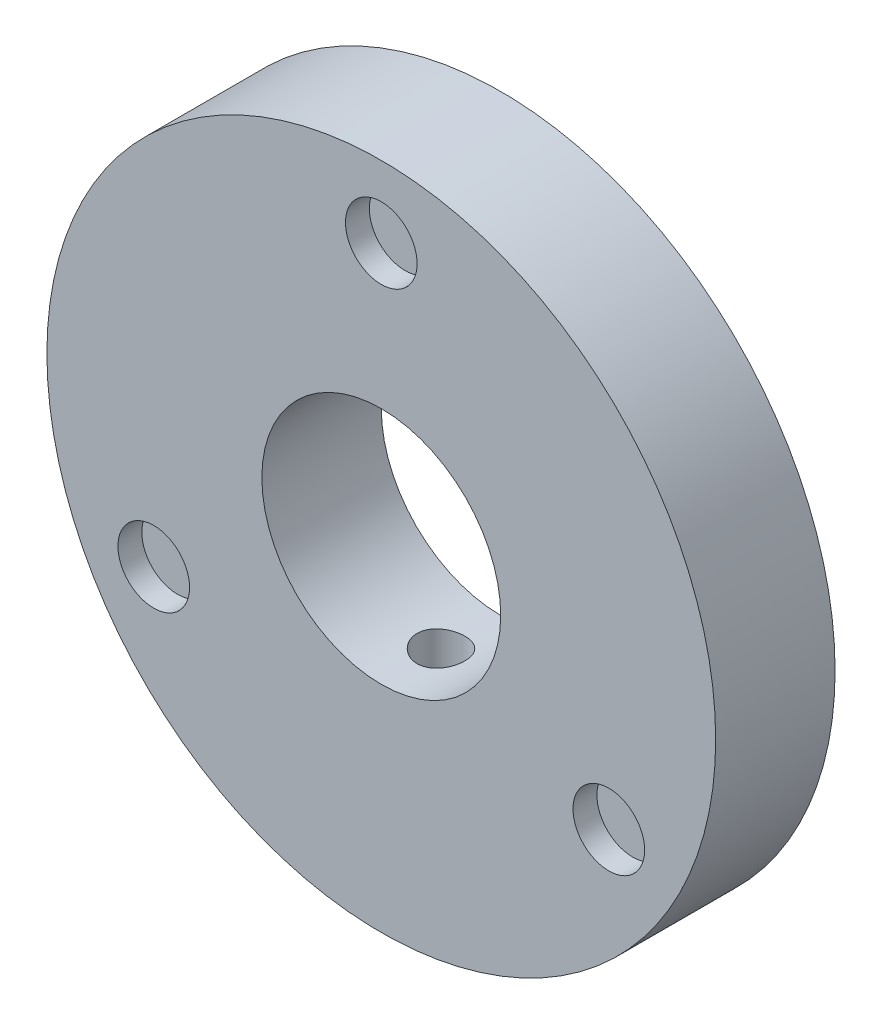
ISO-10303-21;
HEADER;
FILE_DESCRIPTION(('STEP AP214'),'2;1');
FILE_NAME('part.step','',(''),(''),'','','');
FILE_SCHEMA(('AUTOMOTIVE_DESIGN { 1 0 10303 214 1 1 1 1 }'));
ENDSEC;
DATA;
#1=APPLICATION_CONTEXT('core data for automotive mechanical design processes');
#2=APPLICATION_PROTOCOL_DEFINITION('international standard','automotive_design',2000,#1);
#3=PRODUCT_CONTEXT('',#1,'mechanical');
#4=PRODUCT('Part','Part','',(#3));
#5=PRODUCT_RELATED_PRODUCT_CATEGORY('part','',(#4));
#6=PRODUCT_DEFINITION_FORMATION('','',#4);
#7=PRODUCT_DEFINITION_CONTEXT('part definition',#1,'design');
#8=PRODUCT_DEFINITION('design','',#6,#7);
#9=PRODUCT_DEFINITION_SHAPE('','',#8);
#10=(LENGTH_UNIT() NAMED_UNIT(*) SI_UNIT(.MILLI.,.METRE.));
#11=(NAMED_UNIT(*) PLANE_ANGLE_UNIT() SI_UNIT($,.RADIAN.));
#12=(NAMED_UNIT(*) SI_UNIT($,.STERADIAN.) SOLID_ANGLE_UNIT());
#13=UNCERTAINTY_MEASURE_WITH_UNIT(LENGTH_MEASURE(1.E-05),#10,'distance_accuracy_value','');
#14=(GEOMETRIC_REPRESENTATION_CONTEXT(3) GLOBAL_UNCERTAINTY_ASSIGNED_CONTEXT((#13)) GLOBAL_UNIT_ASSIGNED_CONTEXT((#10,
#11,#12)) REPRESENTATION_CONTEXT('',''));
#15=CARTESIAN_POINT('',(0.,0.,0.));
#16=DIRECTION('',(0.,0.,1.));
#17=DIRECTION('',(1.,0.,0.));
#18=AXIS2_PLACEMENT_3D('',#15,#16,#17);
#19=CARTESIAN_POINT('',(0.,0.,5.));
#20=DIRECTION('',(0.,0.,1.));
#21=DIRECTION('',(1.,0.,0.));
#22=AXIS2_PLACEMENT_3D('',#19,#20,#21);
#23=PLANE('',#22);
#24=CARTESIAN_POINT('',(0.,11.,5.));
#25=DIRECTION('',(0.,0.,1.));
#26=DIRECTION('',(1.,0.,0.));
#27=AXIS2_PLACEMENT_3D('',#24,#25,#26);
#28=CIRCLE('',#27,1.5);
#29=CARTESIAN_POINT('',(1.5,11.,5.));
#30=VERTEX_POINT('',#29);
#31=EDGE_CURVE('E72',#30,#30,#28,.T.);
#32=ORIENTED_EDGE('',*,*,#31,.F.);
#33=EDGE_LOOP('',(#32));
#34=FACE_BOUND('',#33,.T.);
#35=CARTESIAN_POINT('',(9.52627944162883,-5.5,5.));
#36=DIRECTION('',(0.,0.,1.));
#37=DIRECTION('',(1.,0.,0.));
#38=AXIS2_PLACEMENT_3D('',#35,#36,#37);
#39=CIRCLE('',#38,1.5);
#40=CARTESIAN_POINT('',(11.0262794416288,-5.5,5.));
#41=VERTEX_POINT('',#40);
#42=EDGE_CURVE('E66',#41,#41,#39,.T.);
#43=ORIENTED_EDGE('',*,*,#42,.F.);
#44=EDGE_LOOP('',(#43));
#45=FACE_BOUND('',#44,.T.);
#46=CARTESIAN_POINT('',(-9.52627944162882,-5.50000000000001,5.));
#47=DIRECTION('',(0.,0.,1.));
#48=DIRECTION('',(1.,0.,0.));
#49=AXIS2_PLACEMENT_3D('',#46,#47,#48);
#50=CIRCLE('',#49,1.5);
#51=CARTESIAN_POINT('',(-8.02627944162882,-5.50000000000001,5.));
#52=VERTEX_POINT('',#51);
#53=EDGE_CURVE('E59',#52,#52,#50,.T.);
#54=ORIENTED_EDGE('',*,*,#53,.F.);
#55=EDGE_LOOP('',(#54));
#56=FACE_BOUND('',#55,.T.);
#57=CARTESIAN_POINT('',(0.,0.,5.));
#58=DIRECTION('',(0.,0.,1.));
#59=DIRECTION('',(1.,0.,0.));
#60=AXIS2_PLACEMENT_3D('',#57,#58,#59);
#61=CIRCLE('',#60,14.);
#62=CARTESIAN_POINT('',(14.,0.,5.));
#63=VERTEX_POINT('',#62);
#64=EDGE_CURVE('E10',#63,#63,#61,.T.);
#65=ORIENTED_EDGE('',*,*,#64,.T.);
#66=EDGE_LOOP('',(#65));
#67=FACE_BOUND('',#66,.T.);
#68=CARTESIAN_POINT('',(0.,0.,5.));
#69=DIRECTION('',(0.,0.,1.));
#70=DIRECTION('',(1.,0.,0.));
#71=AXIS2_PLACEMENT_3D('',#68,#69,#70);
#72=CIRCLE('',#71,5.);
#73=CARTESIAN_POINT('',(5.,0.,5.));
#74=VERTEX_POINT('',#73);
#75=EDGE_CURVE('E51',#74,#74,#72,.T.);
#76=ORIENTED_EDGE('',*,*,#75,.F.);
#77=EDGE_LOOP('',(#76));
#78=FACE_BOUND('',#77,.T.);
#79=ADVANCED_FACE('F32',(#34,#45,#56,#67,#78),#23,.T.);
#80=CARTESIAN_POINT('',(0.,0.,0.));
#81=DIRECTION('',(0.,0.,1.));
#82=DIRECTION('',(1.,0.,0.));
#83=AXIS2_PLACEMENT_3D('',#80,#81,#82);
#84=PLANE('',#83);
#85=CARTESIAN_POINT('',(0.,11.,0.));
#86=DIRECTION('',(0.,0.,-1.));
#87=DIRECTION('',(-1.,0.,0.));
#88=AXIS2_PLACEMENT_3D('',#85,#86,#87);
#89=CIRCLE('',#88,1.5);
#90=CARTESIAN_POINT('',(-1.5,11.,0.));
#91=VERTEX_POINT('',#90);
#92=EDGE_CURVE('E90',#91,#91,#89,.T.);
#93=ORIENTED_EDGE('',*,*,#92,.F.);
#94=EDGE_LOOP('',(#93));
#95=FACE_BOUND('',#94,.T.);
#96=CARTESIAN_POINT('',(-9.52627944162883,-5.5,0.));
#97=DIRECTION('',(0.,0.,-1.));
#98=DIRECTION('',(-1.,0.,0.));
#99=AXIS2_PLACEMENT_3D('',#96,#97,#98);
#100=CIRCLE('',#99,1.5);
#101=CARTESIAN_POINT('',(-11.0262794416288,-5.5,0.));
#102=VERTEX_POINT('',#101);
#103=EDGE_CURVE('E87',#102,#102,#100,.T.);
#104=ORIENTED_EDGE('',*,*,#103,.F.);
#105=EDGE_LOOP('',(#104));
#106=FACE_BOUND('',#105,.T.);
#107=CARTESIAN_POINT('',(9.52627944162882,-5.50000000000001,0.));
#108=DIRECTION('',(0.,0.,-1.));
#109=DIRECTION('',(-1.,0.,0.));
#110=AXIS2_PLACEMENT_3D('',#107,#108,#109);
#111=CIRCLE('',#110,1.5);
#112=CARTESIAN_POINT('',(8.02627944162882,-5.50000000000001,0.));
#113=VERTEX_POINT('',#112);
#114=EDGE_CURVE('E80',#113,#113,#111,.T.);
#115=ORIENTED_EDGE('',*,*,#114,.F.);
#116=EDGE_LOOP('',(#115));
#117=FACE_BOUND('',#116,.T.);
#118=CARTESIAN_POINT('',(0.,0.,0.));
#119=DIRECTION('',(0.,0.,1.));
#120=DIRECTION('',(1.,0.,0.));
#121=AXIS2_PLACEMENT_3D('',#118,#119,#120);
#122=CIRCLE('',#121,14.);
#123=CARTESIAN_POINT('',(14.,0.,0.));
#124=VERTEX_POINT('',#123);
#125=EDGE_CURVE('E46',#124,#124,#122,.T.);
#126=ORIENTED_EDGE('',*,*,#125,.F.);
#127=EDGE_LOOP('',(#126));
#128=FACE_BOUND('',#127,.T.);
#129=CARTESIAN_POINT('',(0.,0.,0.));
#130=DIRECTION('',(0.,0.,1.));
#131=DIRECTION('',(1.,0.,0.));
#132=AXIS2_PLACEMENT_3D('',#129,#130,#131);
#133=CIRCLE('',#132,5.);
#134=CARTESIAN_POINT('',(5.,0.,0.));
#135=VERTEX_POINT('',#134);
#136=EDGE_CURVE('E53',#135,#135,#133,.T.);
#137=ORIENTED_EDGE('',*,*,#136,.T.);
#138=EDGE_LOOP('',(#137));
#139=FACE_BOUND('',#138,.T.);
#140=ADVANCED_FACE('F158',(#95,#106,#117,#128,#139),#84,.F.);
#141=CARTESIAN_POINT('',(0.,0.,5.));
#142=DIRECTION('',(0.,0.,-1.));
#143=DIRECTION('',(-1.,0.,0.));
#144=AXIS2_PLACEMENT_3D('',#141,#142,#143);
#145=CYLINDRICAL_SURFACE('',#144,14.);
#146=CARTESIAN_POINT('',(0.,-14.,3.5));
#147=CARTESIAN_POINT('',(0.0560937195875968,-13.9999995278805,3.49999753867449));
#148=CARTESIAN_POINT('',(0.112226286909792,-13.9996592735534,3.49526437569554));
#149=CARTESIAN_POINT('',(0.222940242827825,-13.9983346441886,3.47645147837645));
#150=CARTESIAN_POINT('',(0.277519769309011,-13.9973495273213,3.46236097938437));
#151=CARTESIAN_POINT('',(0.383508005273699,-13.9948465687616,3.42524127839965));
#152=CARTESIAN_POINT('',(0.434918417825353,-13.9933290161844,3.40221692681631));
#153=CARTESIAN_POINT('',(0.533131800700576,-13.9899316725367,3.34789129106972));
#154=CARTESIAN_POINT('',(0.57993579553587,-13.9880519622899,3.31659185310009));
#155=CARTESIAN_POINT('',(0.667710230995083,-13.9841374302049,3.24653942765135));
#156=CARTESIAN_POINT('',(0.708670674835206,-13.9821023514875,3.20777392767183));
#157=CARTESIAN_POINT('',(0.78350966245635,-13.9781086249156,3.12391591647805));
#158=CARTESIAN_POINT('',(0.81738790447027,-13.9761499803208,3.07882313580004));
#159=CARTESIAN_POINT('',(0.877133128857929,-13.9725279575697,2.98353201713844));
#160=CARTESIAN_POINT('',(0.90299156825972,-13.9708648950769,2.93332830989091));
#161=CARTESIAN_POINT('',(0.945908548498533,-13.9680249962908,2.8292779831948));
#162=CARTESIAN_POINT('',(0.962967207803804,-13.9668481534516,2.77543141279981));
#163=CARTESIAN_POINT('',(0.987772023433274,-13.9651159100812,2.66572214449709));
#164=CARTESIAN_POINT('',(0.995534159645548,-13.9645594432936,2.60986307668516));
#165=CARTESIAN_POINT('',(1.00157493594699,-13.9641275159217,2.49763231997803));
#166=CARTESIAN_POINT('',(0.99985371118415,-13.9642520456326,2.44126063839954));
#167=CARTESIAN_POINT('',(0.986989860817261,-13.9651670787271,2.32971396830984));
#168=CARTESIAN_POINT('',(0.975864556029973,-13.9659563577387,2.27453697087491));
#169=CARTESIAN_POINT('',(0.944535235783244,-13.9681100244431,2.16683556864293));
#170=CARTESIAN_POINT('',(0.924331152377876,-13.96947441644,2.11431118370139));
#171=CARTESIAN_POINT('',(0.875398237128788,-13.9726259720332,2.01335050619488));
#172=CARTESIAN_POINT('',(0.846661581972846,-13.9744135233079,1.96491801797012));
#173=CARTESIAN_POINT('',(0.781484907158016,-13.9782095917553,1.87355754839371));
#174=CARTESIAN_POINT('',(0.745044773537618,-13.9802181121968,1.83062964848936));
#175=CARTESIAN_POINT('',(0.665398149886682,-13.984235230407,1.75139617145384));
#176=CARTESIAN_POINT('',(0.622176676204539,-13.9862438182577,1.71510565389189));
#177=CARTESIAN_POINT('',(0.53024669789692,-13.9900304220396,1.6502933651881));
#178=CARTESIAN_POINT('',(0.481538190751583,-13.9918084378649,1.62177159761398));
#179=CARTESIAN_POINT('',(0.380007407817873,-13.994933765921,1.57330757819669));
#180=CARTESIAN_POINT('',(0.327184840612682,-13.9962810476064,1.55336593477507));
#181=CARTESIAN_POINT('',(0.21892961717693,-13.9983927136546,1.52263848337019));
#182=CARTESIAN_POINT('',(0.163497000757618,-13.999157106905,1.51185253578223));
#183=CARTESIAN_POINT('',(0.0517258175123514,-14.0000157229619,1.49976139665272));
#184=CARTESIAN_POINT('',(-0.00461048696706186,-14.0001114170013,1.4984353917618));
#185=CARTESIAN_POINT('',(-0.116704668210878,-13.9996257716428,1.50524734058643));
#186=CARTESIAN_POINT('',(-0.172462548919165,-13.9990444368641,1.51338522973121));
#187=CARTESIAN_POINT('',(-0.28175820880638,-13.9972710975546,1.53887672153325));
#188=CARTESIAN_POINT('',(-0.335298235381059,-13.9960797283995,1.55622073632118));
#189=CARTESIAN_POINT('',(-0.438707847884634,-13.9932202732766,1.59962238774067));
#190=CARTESIAN_POINT('',(-0.488577390838616,-13.9915521817285,1.62568012637483));
#191=CARTESIAN_POINT('',(-0.583325502595738,-13.9879228706297,1.68582225842689));
#192=CARTESIAN_POINT('',(-0.628195256183018,-13.9859611472029,1.71992050849886));
#193=CARTESIAN_POINT('',(-0.711581265417024,-13.9819668932191,1.79515563076915));
#194=CARTESIAN_POINT('',(-0.750097439789152,-13.9799343617568,1.83629259299253));
#195=CARTESIAN_POINT('',(-0.81975381457621,-13.9760232690702,1.92452741632608));
#196=CARTESIAN_POINT('',(-0.850880480900123,-13.974144994423,1.97163597627656));
#197=CARTESIAN_POINT('',(-0.904781606169517,-13.9707588458058,2.07042319255101));
#198=CARTESIAN_POINT('',(-0.927556129312018,-13.9692509689889,2.12210181374435));
#199=CARTESIAN_POINT('',(-0.96408319547906,-13.9667777512985,2.22851334831294));
#200=CARTESIAN_POINT('',(-0.977844164670157,-13.9658119038395,2.28324335705281));
#201=CARTESIAN_POINT('',(-0.995980985892052,-13.9645302759542,2.39424420130998));
#202=CARTESIAN_POINT('',(-1.00035696518647,-13.9642144867129,2.45051501592297));
#203=CARTESIAN_POINT('',(-0.999598277849288,-13.9642688059132,2.56286562007566));
#204=CARTESIAN_POINT('',(-0.994484882611355,-13.9646373802855,2.61894555523455));
#205=CARTESIAN_POINT('',(-0.97493679967559,-13.9660156418296,2.72944824111976));
#206=CARTESIAN_POINT('',(-0.960502096014837,-13.9670253300994,2.78387098900793));
#207=CARTESIAN_POINT('',(-0.922726193408387,-13.9695716568286,2.88951687093171));
#208=CARTESIAN_POINT('',(-0.899385209704891,-13.9711082825533,2.94074008225718));
#209=CARTESIAN_POINT('',(-0.844461950401682,-13.9745353329988,3.03854388176373));
#210=CARTESIAN_POINT('',(-0.812879855002503,-13.9764257499833,3.08512457142764));
#211=CARTESIAN_POINT('',(-0.742291437596059,-13.9803523591158,3.17242950905793));
#212=CARTESIAN_POINT('',(-0.703269532385188,-13.9823888515422,3.21314114381902));
#213=CARTESIAN_POINT('',(-0.61893408145744,-13.9863754687088,3.28745127369324));
#214=CARTESIAN_POINT('',(-0.573619005588184,-13.9883255722913,3.32104803382943));
#215=CARTESIAN_POINT('',(-0.477918062635485,-13.9919222785503,3.38020732764371));
#216=CARTESIAN_POINT('',(-0.427524792880305,-13.9935684279518,3.4057579017573));
#217=CARTESIAN_POINT('',(-0.323187539568072,-13.9963660310782,3.4480034113939));
#218=CARTESIAN_POINT('',(-0.26924776678137,-13.9975180596647,3.46470864295096));
#219=CARTESIAN_POINT('',(-0.179152112836641,-13.9988981353566,3.4844817090603));
#220=CARTESIAN_POINT('',(-0.143577497674366,-13.9993094807295,3.49029346117997));
#221=CARTESIAN_POINT('',(-0.0720072582065522,-13.9998605643465,3.49805339312684));
#222=CARTESIAN_POINT('',(-0.0360116346850093,-14.0000003030963,3.50000158014758));
#223=CARTESIAN_POINT('',(0.,-14.,3.5));
#224=B_SPLINE_CURVE_WITH_KNOTS('',3,(#146,#147,#148,#149,#150,#151,#152,#153,#154,#155,#156,
#157,#158,#159,#160,#161,#162,#163,#164,#165,#166,#167,#168,#169,#170,#171,#172,#173,#174,#175,
#176,#177,#178,#179,#180,#181,#182,#183,#184,#185,#186,#187,#188,#189,#190,#191,#192,#193,#194,
#195,#196,#197,#198,#199,#200,#201,#202,#203,#204,#205,#206,#207,#208,#209,#210,#211,#212,#213,
#214,#215,#216,#217,#218,#219,#220,#221,#222,#223),.UNSPECIFIED.,.T.,.F.,(4,2,2,2,2,2,2,2,2,2,2,
2,2,2,2,2,2,2,2,2,2,2,2,2,2,2,2,2,2,2,2,2,2,2,2,2,2,2,4),(0.,0.168149687948044,
0.336493150675189,0.504745343175834,0.672960029798431,0.841459122776077,1.00996539390609,
1.17865055208821,1.34733343926393,1.51572595765043,1.68411607627045,1.85219672122828,
2.02027862412909,2.18851511573185,2.35675409631754,2.52537018332172,2.69398634776129,
2.86261446690092,3.03124001477765,3.19949444540965,3.36774772807264,3.53582612344575,
3.7039064864087,3.87227865618554,4.04065297960196,4.20933334637233,4.37801241658876,
4.54653357415658,4.71505244650629,4.88319402294935,5.05133588733887,5.2194736884233,
5.38760781330676,5.55609805471973,5.72462933563736,5.89340994585913,6.06199366008891,
6.16994436212319,6.27789486316506),.UNSPECIFIED.);
#225=CARTESIAN_POINT('',(0.,-14.,3.5));
#226=VERTEX_POINT('',#225);
#227=EDGE_CURVE('E81',#226,#226,#224,.T.);
#228=ORIENTED_EDGE('',*,*,#227,.T.);
#229=EDGE_LOOP('',(#228));
#230=FACE_BOUND('',#229,.T.);
#231=ORIENTED_EDGE('',*,*,#64,.F.);
#232=EDGE_LOOP('',(#231));
#233=FACE_BOUND('',#232,.T.);
#234=ORIENTED_EDGE('',*,*,#125,.T.);
#235=EDGE_LOOP('',(#234));
#236=FACE_BOUND('',#235,.T.);
#237=ADVANCED_FACE('F34',(#230,#233,#236),#145,.T.);
#238=CARTESIAN_POINT('',(0.,0.,5.));
#239=DIRECTION('',(0.,0.,-1.));
#240=DIRECTION('',(-1.,0.,0.));
#241=AXIS2_PLACEMENT_3D('',#238,#239,#240);
#242=CYLINDRICAL_SURFACE('',#241,5.);
#243=CARTESIAN_POINT('',(0.,-5.,3.5));
#244=CARTESIAN_POINT('',(0.0555769067926332,-4.99999897580871,3.49999795550165));
#245=CARTESIAN_POINT('',(0.111179660201522,-4.99906385178231,3.49535115703235));
#246=CARTESIAN_POINT('',(0.220813507689019,-4.99542365623231,3.47690149988475));
#247=CARTESIAN_POINT('',(0.274843317541356,-4.99271717860186,3.46309136719849));
#248=CARTESIAN_POINT('',(0.379730305263313,-4.98583649278287,3.42675872637921));
#249=CARTESIAN_POINT('',(0.430590467933134,-4.98166369076718,3.40424456315531));
#250=CARTESIAN_POINT('',(0.527807988864225,-4.97230398035314,3.35116775248871));
#251=CARTESIAN_POINT('',(0.574165615075812,-4.96711713235707,3.3206055843928));
#252=CARTESIAN_POINT('',(0.661693477314865,-4.9562216532997,3.25186150570857));
#253=CARTESIAN_POINT('',(0.702793951158524,-4.95050745504347,3.2135916446088));
#254=CARTESIAN_POINT('',(0.778036756608028,-4.93924180452588,3.1307075836083));
#255=CARTESIAN_POINT('',(0.812178544770424,-4.93369036500424,3.08609288866488));
#256=CARTESIAN_POINT('',(0.87283175334762,-4.92332441812615,2.99128380698813));
#257=CARTESIAN_POINT('',(0.899270938865866,-4.91851707364946,2.94104235620364));
#258=CARTESIAN_POINT('',(0.943305666580308,-4.91026268058418,2.83671818099592));
#259=CARTESIAN_POINT('',(0.960902082437238,-4.90681549761962,2.78263583665366));
#260=CARTESIAN_POINT('',(0.986525299884827,-4.90172805252204,2.67291563609208));
#261=CARTESIAN_POINT('',(0.994674497958777,-4.90006470107188,2.61730745585777));
#262=CARTESIAN_POINT('',(1.00155212772612,-4.89866375060627,2.50549017863566));
#263=CARTESIAN_POINT('',(1.0002815227135,-4.89892595467841,2.44928114367986));
#264=CARTESIAN_POINT('',(0.988454573101819,-4.90132551148185,2.338753211979));
#265=CARTESIAN_POINT('',(0.978038540243905,-4.90343452858763,2.28441859437269));
#266=CARTESIAN_POINT('',(0.948437884623051,-4.90924546160001,2.178283923337));
#267=CARTESIAN_POINT('',(0.929252843100681,-4.91294745357779,2.12648399108099));
#268=CARTESIAN_POINT('',(0.88252478367472,-4.92155618500408,2.0264847382964));
#269=CARTESIAN_POINT('',(0.854926151232114,-4.92647089813704,1.97831212043083));
#270=CARTESIAN_POINT('',(0.792193574572679,-4.93694618773062,1.88722915002719));
#271=CARTESIAN_POINT('',(0.757058764356829,-4.94250683838366,1.84431940314884));
#272=CARTESIAN_POINT('',(0.679499934560584,-4.95377021241462,1.76417059754306));
#273=CARTESIAN_POINT('',(0.636956161212445,-4.95947369210905,1.72704743214087));
#274=CARTESIAN_POINT('',(0.54618502406201,-4.97028848714408,1.66044615369878));
#275=CARTESIAN_POINT('',(0.497957587379389,-4.97539979488974,1.63096813870642));
#276=CARTESIAN_POINT('',(0.397059386878921,-4.98446690160887,1.58047249077403));
#277=CARTESIAN_POINT('',(0.3443818195853,-4.98842088848272,1.55946810635546));
#278=CARTESIAN_POINT('',(0.236148976448665,-4.99471408987858,1.52663952596143));
#279=CARTESIAN_POINT('',(0.18059405007245,-4.99705350000531,1.51481421792637));
#280=CARTESIAN_POINT('',(0.0691794056271507,-4.99982671866868,1.50084354620572));
#281=CARTESIAN_POINT('',(0.0133403283255765,-5.0002917465247,1.49853958045973));
#282=CARTESIAN_POINT('',(-0.0979249341927137,-4.99935051930103,1.50324985894218));
#283=CARTESIAN_POINT('',(-0.153351142443793,-4.99794436941446,1.5102635793526));
#284=CARTESIAN_POINT('',(-0.26170565994654,-4.99343832008018,1.53327837354396));
#285=CARTESIAN_POINT('',(-0.314651948339902,-4.99035376404206,1.5491980684979));
#286=CARTESIAN_POINT('',(-0.417123627499667,-4.98283552061033,1.58948398265581));
#287=CARTESIAN_POINT('',(-0.466648761637539,-4.97840173214227,1.61385083467683));
#288=CARTESIAN_POINT('',(-0.561541173686217,-4.96859911533294,1.67068249065131));
#289=CARTESIAN_POINT('',(-0.606850126752187,-4.96321950437052,1.70324278103895));
#290=CARTESIAN_POINT('',(-0.691418019119206,-4.95214734829882,1.77540919120728));
#291=CARTESIAN_POINT('',(-0.730676308930762,-4.94645476968388,1.81501606639987));
#292=CARTESIAN_POINT('',(-0.802640590774176,-4.93529303556965,1.90087335189112));
#293=CARTESIAN_POINT('',(-0.835237702448655,-4.92982860233304,1.94721574422134));
#294=CARTESIAN_POINT('',(-0.892185420051205,-4.91984191796194,2.04481136135668));
#295=CARTESIAN_POINT('',(-0.916536355922902,-4.91531962913342,2.09606438957355));
#296=CARTESIAN_POINT('',(-0.95615184158196,-4.90776740584383,2.20176824614955));
#297=CARTESIAN_POINT('',(-0.97146349979105,-4.90472974872187,2.25620084121032));
#298=CARTESIAN_POINT('',(-0.992708651627196,-4.90047436792025,2.3669334534909));
#299=CARTESIAN_POINT('',(-0.998643368225112,-4.89925640691111,2.42323322620935));
#300=CARTESIAN_POINT('',(-1.00092091086747,-4.89879149631379,2.53500886454432));
#301=CARTESIAN_POINT('',(-0.997435788070896,-4.89950919189301,2.59048114892701));
#302=CARTESIAN_POINT('',(-0.981352304100061,-4.90275573484614,2.70003164990503));
#303=CARTESIAN_POINT('',(-0.968754016129298,-4.90528456767169,2.7541098776948));
#304=CARTESIAN_POINT('',(-0.934878568498954,-4.91185264219159,2.85922771124054));
#305=CARTESIAN_POINT('',(-0.913622506717345,-4.91588821018831,2.91027436050241));
#306=CARTESIAN_POINT('',(-0.863054644601604,-4.9250171497417,3.00810372073444));
#307=CARTESIAN_POINT('',(-0.833742168774882,-4.93011060998894,3.05488607372514));
#308=CARTESIAN_POINT('',(-0.767305914786414,-4.94088960523225,3.14371557215031));
#309=CARTESIAN_POINT('',(-0.730057887235181,-4.94658372909699,3.1856687652676));
#310=CARTESIAN_POINT('',(-0.649064369013141,-4.95786081871955,3.26278620552917));
#311=CARTESIAN_POINT('',(-0.605317387153335,-4.96344375863184,3.29794889031727));
#312=CARTESIAN_POINT('',(-0.512017629088247,-4.97393832387971,3.36083464394645));
#313=CARTESIAN_POINT('',(-0.462408884429835,-4.97884231219246,3.38847600328003));
#314=CARTESIAN_POINT('',(-0.359166360940733,-4.98735125085,3.43498612259659));
#315=CARTESIAN_POINT('',(-0.305536260863127,-4.99095737138616,3.45386278953249));
#316=CARTESIAN_POINT('',(-0.20982148892378,-4.99576372595371,3.47865194804472));
#317=CARTESIAN_POINT('',(-0.168281664013785,-4.99734303158452,3.48664319370776));
#318=CARTESIAN_POINT('',(-0.0844995252100675,-4.99946154139893,3.49731791235836));
#319=CARTESIAN_POINT('',(-0.0422572337486193,-5.00000077873155,3.50000155450977));
#320=CARTESIAN_POINT('',(0.,-5.,3.5));
#321=B_SPLINE_CURVE_WITH_KNOTS('',3,(#243,#244,#245,#246,#247,#248,#249,#250,#251,#252,#253,
#254,#255,#256,#257,#258,#259,#260,#261,#262,#263,#264,#265,#266,#267,#268,#269,#270,#271,#272,
#273,#274,#275,#276,#277,#278,#279,#280,#281,#282,#283,#284,#285,#286,#287,#288,#289,#290,#291,
#292,#293,#294,#295,#296,#297,#298,#299,#300,#301,#302,#303,#304,#305,#306,#307,#308,#309,#310,
#311,#312,#313,#314,#315,#316,#317,#318,#319,#320),.UNSPECIFIED.,.T.,.F.,(4,2,2,2,2,2,2,2,2,2,2,
2,2,2,2,2,2,2,2,2,2,2,2,2,2,2,2,2,2,2,2,2,2,2,2,2,2,2,4),(0.,0.166576130661258,
0.333284650691323,0.499833735250341,0.666372902230863,0.834932670112185,1.00350559674736,
1.17361195005923,1.34370149365197,1.51156185103587,1.67940504281225,1.84471727006278,
2.0100373925373,2.17647490203593,2.3429315474967,2.51238252491351,2.6818356753982,
2.85155274854024,3.02124925698036,3.18810735676265,3.35495607657868,3.52030453950723,
3.68566539216022,3.85305066033359,4.0204538834593,4.19040628579226,4.36035188723466,
4.52940381032723,4.69843368330415,4.86439722567701,5.03035943492608,5.1959196125311,
5.36149367581867,5.52988076239143,5.6983065453293,5.86849496675637,6.03852955517518,
6.16518775289894,6.29184191370996),.UNSPECIFIED.);
#322=CARTESIAN_POINT('',(0.,-5.,3.5));
#323=VERTEX_POINT('',#322);
#324=EDGE_CURVE('E37',#323,#323,#321,.T.);
#325=ORIENTED_EDGE('',*,*,#324,.F.);
#326=EDGE_LOOP('',(#325));
#327=FACE_BOUND('',#326,.T.);
#328=ORIENTED_EDGE('',*,*,#75,.T.);
#329=EDGE_LOOP('',(#328));
#330=FACE_BOUND('',#329,.T.);
#331=ORIENTED_EDGE('',*,*,#136,.F.);
#332=EDGE_LOOP('',(#331));
#333=FACE_BOUND('',#332,.T.);
#334=ADVANCED_FACE('F151',(#327,#330,#333),#242,.F.);
#335=CARTESIAN_POINT('',(-9.52627944162882,-5.50000000000001,4.));
#336=DIRECTION('',(0.,0.,1.));
#337=DIRECTION('',(1.,0.,0.));
#338=AXIS2_PLACEMENT_3D('',#335,#336,#337);
#339=CYLINDRICAL_SURFACE('',#338,1.5);
#340=CARTESIAN_POINT('',(-9.52627944162882,-5.50000000000001,4.));
#341=DIRECTION('',(0.,0.,1.));
#342=DIRECTION('',(1.,0.,0.));
#343=AXIS2_PLACEMENT_3D('',#340,#341,#342);
#344=CIRCLE('',#343,1.5);
#345=CARTESIAN_POINT('',(-8.02627944162882,-5.50000000000001,4.));
#346=VERTEX_POINT('',#345);
#347=EDGE_CURVE('E62',#346,#346,#344,.T.);
#348=ORIENTED_EDGE('',*,*,#347,.F.);
#349=EDGE_LOOP('',(#348));
#350=FACE_BOUND('',#349,.T.);
#351=ORIENTED_EDGE('',*,*,#53,.T.);
#352=EDGE_LOOP('',(#351));
#353=FACE_BOUND('',#352,.T.);
#354=ADVANCED_FACE('F148',(#350,#353),#339,.F.);
#355=CARTESIAN_POINT('',(-9.52627944162882,-5.50000000000001,4.));
#356=DIRECTION('',(0.,0.,1.));
#357=DIRECTION('',(1.,0.,0.));
#358=AXIS2_PLACEMENT_3D('',#355,#356,#357);
#359=PLANE('',#358);
#360=ORIENTED_EDGE('',*,*,#347,.T.);
#361=EDGE_LOOP('',(#360));
#362=FACE_BOUND('',#361,.T.);
#363=ADVANCED_FACE('F144',(#362),#359,.T.);
#364=CARTESIAN_POINT('',(9.52627944162883,-5.5,4.));
#365=DIRECTION('',(0.,0.,1.));
#366=DIRECTION('',(1.,0.,0.));
#367=AXIS2_PLACEMENT_3D('',#364,#365,#366);
#368=CYLINDRICAL_SURFACE('',#367,1.5);
#369=CARTESIAN_POINT('',(9.52627944162883,-5.5,4.));
#370=DIRECTION('',(0.,0.,1.));
#371=DIRECTION('',(1.,0.,0.));
#372=AXIS2_PLACEMENT_3D('',#369,#370,#371);
#373=CIRCLE('',#372,1.5);
#374=CARTESIAN_POINT('',(11.0262794416288,-5.5,4.));
#375=VERTEX_POINT('',#374);
#376=EDGE_CURVE('E69',#375,#375,#373,.T.);
#377=ORIENTED_EDGE('',*,*,#376,.F.);
#378=EDGE_LOOP('',(#377));
#379=FACE_BOUND('',#378,.T.);
#380=ORIENTED_EDGE('',*,*,#42,.T.);
#381=EDGE_LOOP('',(#380));
#382=FACE_BOUND('',#381,.T.);
#383=ADVANCED_FACE('F140',(#379,#382),#368,.F.);
#384=CARTESIAN_POINT('',(9.52627944162883,-5.5,4.));
#385=DIRECTION('',(0.,0.,1.));
#386=DIRECTION('',(1.,0.,0.));
#387=AXIS2_PLACEMENT_3D('',#384,#385,#386);
#388=PLANE('',#387);
#389=ORIENTED_EDGE('',*,*,#376,.T.);
#390=EDGE_LOOP('',(#389));
#391=FACE_BOUND('',#390,.T.);
#392=ADVANCED_FACE('F136',(#391),#388,.T.);
#393=CARTESIAN_POINT('',(0.,11.,4.));
#394=DIRECTION('',(0.,0.,1.));
#395=DIRECTION('',(1.,0.,0.));
#396=AXIS2_PLACEMENT_3D('',#393,#394,#395);
#397=CYLINDRICAL_SURFACE('',#396,1.5);
#398=CARTESIAN_POINT('',(0.,11.,4.));
#399=DIRECTION('',(0.,0.,1.));
#400=DIRECTION('',(1.,0.,0.));
#401=AXIS2_PLACEMENT_3D('',#398,#399,#400);
#402=CIRCLE('',#401,1.5);
#403=CARTESIAN_POINT('',(1.5,11.,4.));
#404=VERTEX_POINT('',#403);
#405=EDGE_CURVE('E56',#404,#404,#402,.T.);
#406=ORIENTED_EDGE('',*,*,#405,.F.);
#407=EDGE_LOOP('',(#406));
#408=FACE_BOUND('',#407,.T.);
#409=ORIENTED_EDGE('',*,*,#31,.T.);
#410=EDGE_LOOP('',(#409));
#411=FACE_BOUND('',#410,.T.);
#412=ADVANCED_FACE('F132',(#408,#411),#397,.F.);
#413=CARTESIAN_POINT('',(0.,11.,4.));
#414=DIRECTION('',(0.,0.,1.));
#415=DIRECTION('',(1.,0.,0.));
#416=AXIS2_PLACEMENT_3D('',#413,#414,#415);
#417=PLANE('',#416);
#418=ORIENTED_EDGE('',*,*,#405,.T.);
#419=EDGE_LOOP('',(#418));
#420=FACE_BOUND('',#419,.T.);
#421=ADVANCED_FACE('F125',(#420),#417,.T.);
#422=CARTESIAN_POINT('',(9.52627944162882,-5.50000000000001,1.));
#423=DIRECTION('',(0.,0.,-1.));
#424=DIRECTION('',(-1.,0.,0.));
#425=AXIS2_PLACEMENT_3D('',#422,#423,#424);
#426=CYLINDRICAL_SURFACE('',#425,1.5);
#427=CARTESIAN_POINT('',(9.52627944162882,-5.50000000000001,1.));
#428=DIRECTION('',(0.,0.,-1.));
#429=DIRECTION('',(-1.,0.,0.));
#430=AXIS2_PLACEMENT_3D('',#427,#428,#429);
#431=CIRCLE('',#430,1.5);
#432=CARTESIAN_POINT('',(8.02627944162882,-5.50000000000001,1.));
#433=VERTEX_POINT('',#432);
#434=EDGE_CURVE('E77',#433,#433,#431,.T.);
#435=ORIENTED_EDGE('',*,*,#434,.F.);
#436=EDGE_LOOP('',(#435));
#437=FACE_BOUND('',#436,.T.);
#438=ORIENTED_EDGE('',*,*,#114,.T.);
#439=EDGE_LOOP('',(#438));
#440=FACE_BOUND('',#439,.T.);
#441=ADVANCED_FACE('F122',(#437,#440),#426,.F.);
#442=CARTESIAN_POINT('',(9.52627944162882,-5.50000000000001,1.));
#443=DIRECTION('',(0.,0.,-1.));
#444=DIRECTION('',(-1.,0.,0.));
#445=AXIS2_PLACEMENT_3D('',#442,#443,#444);
#446=PLANE('',#445);
#447=ORIENTED_EDGE('',*,*,#434,.T.);
#448=EDGE_LOOP('',(#447));
#449=FACE_BOUND('',#448,.T.);
#450=ADVANCED_FACE('F117',(#449),#446,.T.);
#451=CARTESIAN_POINT('',(-9.52627944162883,-5.5,1.));
#452=DIRECTION('',(0.,0.,-1.));
#453=DIRECTION('',(-1.,0.,0.));
#454=AXIS2_PLACEMENT_3D('',#451,#452,#453);
#455=CYLINDRICAL_SURFACE('',#454,1.5);
#456=CARTESIAN_POINT('',(-9.52627944162883,-5.5,1.));
#457=DIRECTION('',(0.,0.,-1.));
#458=DIRECTION('',(-1.,0.,0.));
#459=AXIS2_PLACEMENT_3D('',#456,#457,#458);
#460=CIRCLE('',#459,1.5);
#461=CARTESIAN_POINT('',(-11.0262794416288,-5.5,1.));
#462=VERTEX_POINT('',#461);
#463=EDGE_CURVE('E84',#462,#462,#460,.T.);
#464=ORIENTED_EDGE('',*,*,#463,.F.);
#465=EDGE_LOOP('',(#464));
#466=FACE_BOUND('',#465,.T.);
#467=ORIENTED_EDGE('',*,*,#103,.T.);
#468=EDGE_LOOP('',(#467));
#469=FACE_BOUND('',#468,.T.);
#470=ADVANCED_FACE('F114',(#466,#469),#455,.F.);
#471=CARTESIAN_POINT('',(-9.52627944162883,-5.5,1.));
#472=DIRECTION('',(0.,0.,-1.));
#473=DIRECTION('',(-1.,0.,0.));
#474=AXIS2_PLACEMENT_3D('',#471,#472,#473);
#475=PLANE('',#474);
#476=ORIENTED_EDGE('',*,*,#463,.T.);
#477=EDGE_LOOP('',(#476));
#478=FACE_BOUND('',#477,.T.);
#479=ADVANCED_FACE('F112',(#478),#475,.T.);
#480=CARTESIAN_POINT('',(0.,11.,1.));
#481=DIRECTION('',(0.,0.,-1.));
#482=DIRECTION('',(-1.,0.,0.));
#483=AXIS2_PLACEMENT_3D('',#480,#481,#482);
#484=CYLINDRICAL_SURFACE('',#483,1.5);
#485=CARTESIAN_POINT('',(0.,11.,1.));
#486=DIRECTION('',(0.,0.,-1.));
#487=DIRECTION('',(-1.,0.,0.));
#488=AXIS2_PLACEMENT_3D('',#485,#486,#487);
#489=CIRCLE('',#488,1.5);
#490=CARTESIAN_POINT('',(-1.5,11.,1.));
#491=VERTEX_POINT('',#490);
#492=EDGE_CURVE('E63',#491,#491,#489,.T.);
#493=ORIENTED_EDGE('',*,*,#492,.F.);
#494=EDGE_LOOP('',(#493));
#495=FACE_BOUND('',#494,.T.);
#496=ORIENTED_EDGE('',*,*,#92,.T.);
#497=EDGE_LOOP('',(#496));
#498=FACE_BOUND('',#497,.T.);
#499=ADVANCED_FACE('F108',(#495,#498),#484,.F.);
#500=CARTESIAN_POINT('',(0.,11.,1.));
#501=DIRECTION('',(0.,0.,-1.));
#502=DIRECTION('',(-1.,0.,0.));
#503=AXIS2_PLACEMENT_3D('',#500,#501,#502);
#504=PLANE('',#503);
#505=ORIENTED_EDGE('',*,*,#492,.T.);
#506=EDGE_LOOP('',(#505));
#507=FACE_BOUND('',#506,.T.);
#508=ADVANCED_FACE('F103',(#507),#504,.T.);
#509=CARTESIAN_POINT('',(0.,-30.,2.5));
#510=DIRECTION('',(0.,1.,0.));
#511=DIRECTION('',(0.,0.,1.));
#512=AXIS2_PLACEMENT_3D('',#509,#510,#511);
#513=CYLINDRICAL_SURFACE('',#512,1.);
#514=ORIENTED_EDGE('',*,*,#324,.T.);
#515=EDGE_LOOP('',(#514));
#516=FACE_BOUND('',#515,.T.);
#517=ORIENTED_EDGE('',*,*,#227,.F.);
#518=EDGE_LOOP('',(#517));
#519=FACE_BOUND('',#518,.T.);
#520=ADVANCED_FACE('F99',(#516,#519),#513,.F.);
#521=CLOSED_SHELL('',(#79,#140,#237,#334,#354,#363,#383,#392,#412,#421,#441,#450,#470,#479,#499,
#508,#520));
#522=MANIFOLD_SOLID_BREP('B2',#521);
#523=ADVANCED_BREP_SHAPE_REPRESENTATION('',(#18,#522),#14);
#524=SHAPE_DEFINITION_REPRESENTATION(#9,#523);
ENDSEC;
END-ISO-10303-21;
